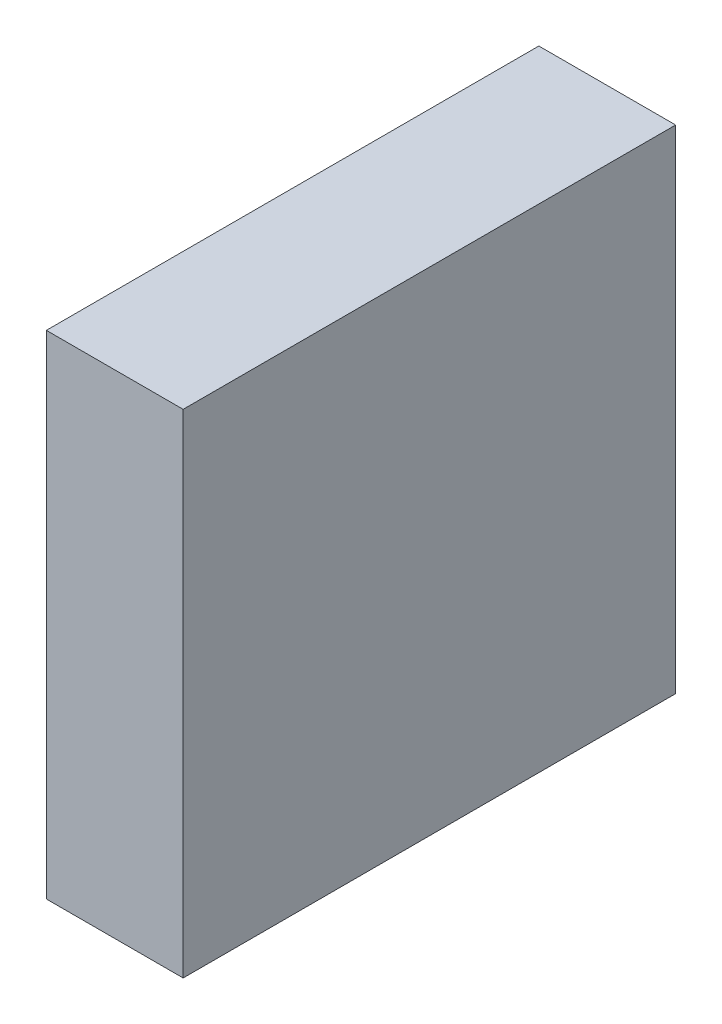
ISO-10303-21;
HEADER;
FILE_DESCRIPTION(('STEP AP214'),'2;1');
FILE_NAME('part.step','',(''),(''),'','','');
FILE_SCHEMA(('AUTOMOTIVE_DESIGN { 1 0 10303 214 1 1 1 1 }'));
ENDSEC;
DATA;
#1=APPLICATION_CONTEXT('core data for automotive mechanical design processes');
#2=APPLICATION_PROTOCOL_DEFINITION('international standard','automotive_design',2000,#1);
#3=PRODUCT_CONTEXT('',#1,'mechanical');
#4=PRODUCT('Part','Part','',(#3));
#5=PRODUCT_RELATED_PRODUCT_CATEGORY('part','',(#4));
#6=PRODUCT_DEFINITION_FORMATION('','',#4);
#7=PRODUCT_DEFINITION_CONTEXT('part definition',#1,'design');
#8=PRODUCT_DEFINITION('design','',#6,#7);
#9=PRODUCT_DEFINITION_SHAPE('','',#8);
#10=(LENGTH_UNIT() NAMED_UNIT(*) SI_UNIT(.MILLI.,.METRE.));
#11=(NAMED_UNIT(*) PLANE_ANGLE_UNIT() SI_UNIT($,.RADIAN.));
#12=(NAMED_UNIT(*) SI_UNIT($,.STERADIAN.) SOLID_ANGLE_UNIT());
#13=UNCERTAINTY_MEASURE_WITH_UNIT(LENGTH_MEASURE(1.E-05),#10,'distance_accuracy_value','');
#14=(GEOMETRIC_REPRESENTATION_CONTEXT(3) GLOBAL_UNCERTAINTY_ASSIGNED_CONTEXT((#13)) GLOBAL_UNIT_ASSIGNED_CONTEXT((#10,
#11,#12)) REPRESENTATION_CONTEXT('',''));
#15=CARTESIAN_POINT('',(0.,0.,0.));
#16=DIRECTION('',(0.,0.,1.));
#17=DIRECTION('',(1.,0.,0.));
#18=AXIS2_PLACEMENT_3D('',#15,#16,#17);
#19=CARTESIAN_POINT('',(0.2499995,-0.8999982,0.));
#20=DIRECTION('',(-1.,0.,0.));
#21=DIRECTION('',(0.,0.,1.));
#22=AXIS2_PLACEMENT_3D('',#19,#20,#21);
#23=PLANE('',#22);
#24=DIRECTION('',(0.,0.,-1.));
#25=VECTOR('',#24,1.);
#26=CARTESIAN_POINT('',(0.2499995,0.90000074,0.));
#27=LINE('',#26,#25);
#28=CARTESIAN_POINT('',(0.2499995,0.90000074,0.));
#29=VERTEX_POINT('',#28);
#30=CARTESIAN_POINT('',(0.2499995,0.90000074,1.79999894));
#31=VERTEX_POINT('',#30);
#32=EDGE_CURVE('E19',#29,#31,#27,.F.);
#33=ORIENTED_EDGE('',*,*,#32,.T.);
#34=DIRECTION('',(0.,1.,0.));
#35=VECTOR('',#34,1.);
#36=CARTESIAN_POINT('',(0.2499995,0.90000074,1.79999894));
#37=LINE('',#36,#35);
#38=CARTESIAN_POINT('',(0.2499995,-0.8999982,1.79999894));
#39=VERTEX_POINT('',#38);
#40=EDGE_CURVE('E54',#31,#39,#37,.F.);
#41=ORIENTED_EDGE('',*,*,#40,.T.);
#42=DIRECTION('',(0.,0.,1.));
#43=VECTOR('',#42,1.);
#44=CARTESIAN_POINT('',(0.2499995,-0.8999982,0.));
#45=LINE('',#44,#43);
#46=CARTESIAN_POINT('',(0.2499995,-0.8999982,0.));
#47=VERTEX_POINT('',#46);
#48=EDGE_CURVE('E75',#39,#47,#45,.F.);
#49=ORIENTED_EDGE('',*,*,#48,.T.);
#50=DIRECTION('',(0.,1.,0.));
#51=VECTOR('',#50,1.);
#52=CARTESIAN_POINT('',(0.2499995,0.90000074,0.));
#53=LINE('',#52,#51);
#54=EDGE_CURVE('E57',#29,#47,#53,.F.);
#55=ORIENTED_EDGE('',*,*,#54,.F.);
#56=EDGE_LOOP('',(#33,#41,#49,#55));
#57=FACE_BOUND('',#56,.T.);
#58=ADVANCED_FACE('F16',(#57),#23,.F.);
#59=CARTESIAN_POINT('',(0.2499995,0.90000074,0.));
#60=DIRECTION('',(0.,-1.,0.));
#61=DIRECTION('',(0.,0.,-1.));
#62=AXIS2_PLACEMENT_3D('',#59,#60,#61);
#63=PLANE('',#62);
#64=DIRECTION('',(0.,0.,-1.));
#65=VECTOR('',#64,1.);
#66=CARTESIAN_POINT('',(-0.2499995,0.90000074,0.));
#67=LINE('',#66,#65);
#68=CARTESIAN_POINT('',(-0.2499995,0.90000074,0.));
#69=VERTEX_POINT('',#68);
#70=CARTESIAN_POINT('',(-0.2499995,0.90000074,1.79999894));
#71=VERTEX_POINT('',#70);
#72=EDGE_CURVE('E72',#69,#71,#67,.F.);
#73=ORIENTED_EDGE('',*,*,#72,.T.);
#74=DIRECTION('',(-1.,0.,0.));
#75=VECTOR('',#74,1.);
#76=CARTESIAN_POINT('',(-0.2499995,0.90000074,1.79999894));
#77=LINE('',#76,#75);
#78=EDGE_CURVE('E62',#71,#31,#77,.F.);
#79=ORIENTED_EDGE('',*,*,#78,.T.);
#80=ORIENTED_EDGE('',*,*,#32,.F.);
#81=DIRECTION('',(-1.,0.,0.));
#82=VECTOR('',#81,1.);
#83=CARTESIAN_POINT('',(-0.2499995,0.90000074,0.));
#84=LINE('',#83,#82);
#85=EDGE_CURVE('E77',#69,#29,#84,.F.);
#86=ORIENTED_EDGE('',*,*,#85,.F.);
#87=EDGE_LOOP('',(#73,#79,#80,#86));
#88=FACE_BOUND('',#87,.T.);
#89=ADVANCED_FACE('F71',(#88),#63,.F.);
#90=CARTESIAN_POINT('',(-0.2499995,0.90000074,1.79999894));
#91=DIRECTION('',(0.,0.,-1.));
#92=DIRECTION('',(-1.,0.,0.));
#93=AXIS2_PLACEMENT_3D('',#90,#91,#92);
#94=PLANE('',#93);
#95=DIRECTION('',(1.,0.,0.));
#96=VECTOR('',#95,1.);
#97=CARTESIAN_POINT('',(-0.2499995,-0.8999982,1.79999894));
#98=LINE('',#97,#96);
#99=CARTESIAN_POINT('',(-0.2499995,-0.8999982,1.79999894));
#100=VERTEX_POINT('',#99);
#101=EDGE_CURVE('E68',#100,#39,#98,.T.);
#102=ORIENTED_EDGE('',*,*,#101,.T.);
#103=ORIENTED_EDGE('',*,*,#40,.F.);
#104=ORIENTED_EDGE('',*,*,#78,.F.);
#105=DIRECTION('',(0.,1.,0.));
#106=VECTOR('',#105,1.);
#107=CARTESIAN_POINT('',(-0.2499995,0.90000074,1.79999894));
#108=LINE('',#107,#106);
#109=EDGE_CURVE('E82',#71,#100,#108,.F.);
#110=ORIENTED_EDGE('',*,*,#109,.T.);
#111=EDGE_LOOP('',(#102,#103,#104,#110));
#112=FACE_BOUND('',#111,.T.);
#113=ADVANCED_FACE('F65',(#112),#94,.F.);
#114=CARTESIAN_POINT('',(-0.2499995,-0.8999982,0.));
#115=DIRECTION('',(0.,1.,0.));
#116=DIRECTION('',(0.,0.,1.));
#117=AXIS2_PLACEMENT_3D('',#114,#115,#116);
#118=PLANE('',#117);
#119=ORIENTED_EDGE('',*,*,#48,.F.);
#120=ORIENTED_EDGE('',*,*,#101,.F.);
#121=DIRECTION('',(0.,0.,-1.));
#122=VECTOR('',#121,1.);
#123=CARTESIAN_POINT('',(-0.2499995,-0.8999982,0.));
#124=LINE('',#123,#122);
#125=CARTESIAN_POINT('',(-0.2499995,-0.8999982,0.));
#126=VERTEX_POINT('',#125);
#127=EDGE_CURVE('E25',#100,#126,#124,.T.);
#128=ORIENTED_EDGE('',*,*,#127,.T.);
#129=DIRECTION('',(-1.,0.,0.));
#130=VECTOR('',#129,1.);
#131=CARTESIAN_POINT('',(-0.2499995,-0.8999982,0.));
#132=LINE('',#131,#130);
#133=EDGE_CURVE('E33',#47,#126,#132,.T.);
#134=ORIENTED_EDGE('',*,*,#133,.F.);
#135=EDGE_LOOP('',(#119,#120,#128,#134));
#136=FACE_BOUND('',#135,.T.);
#137=ADVANCED_FACE('F87',(#136),#118,.F.);
#138=CARTESIAN_POINT('',(-0.2499995,0.90000074,0.));
#139=DIRECTION('',(0.,0.,-1.));
#140=DIRECTION('',(-1.,0.,0.));
#141=AXIS2_PLACEMENT_3D('',#138,#139,#140);
#142=PLANE('',#141);
#143=ORIENTED_EDGE('',*,*,#133,.T.);
#144=DIRECTION('',(0.,1.,0.));
#145=VECTOR('',#144,1.);
#146=CARTESIAN_POINT('',(-0.2499995,0.90000074,0.));
#147=LINE('',#146,#145);
#148=EDGE_CURVE('E11',#126,#69,#147,.T.);
#149=ORIENTED_EDGE('',*,*,#148,.T.);
#150=ORIENTED_EDGE('',*,*,#85,.T.);
#151=ORIENTED_EDGE('',*,*,#54,.T.);
#152=EDGE_LOOP('',(#143,#149,#150,#151));
#153=FACE_BOUND('',#152,.T.);
#154=ADVANCED_FACE('F90',(#153),#142,.T.);
#155=CARTESIAN_POINT('',(-0.2499995,0.90000074,0.));
#156=DIRECTION('',(1.,0.,0.));
#157=DIRECTION('',(0.,0.,-1.));
#158=AXIS2_PLACEMENT_3D('',#155,#156,#157);
#159=PLANE('',#158);
#160=ORIENTED_EDGE('',*,*,#127,.F.);
#161=ORIENTED_EDGE('',*,*,#109,.F.);
#162=ORIENTED_EDGE('',*,*,#72,.F.);
#163=ORIENTED_EDGE('',*,*,#148,.F.);
#164=EDGE_LOOP('',(#160,#161,#162,#163));
#165=FACE_BOUND('',#164,.T.);
#166=ADVANCED_FACE('F89',(#165),#159,.F.);
#167=CLOSED_SHELL('',(#58,#89,#113,#137,#154,#166));
#168=MANIFOLD_SOLID_BREP('B1',#167);
#169=ADVANCED_BREP_SHAPE_REPRESENTATION('',(#18,#168),#14);
#170=SHAPE_DEFINITION_REPRESENTATION(#9,#169);
ENDSEC;
END-ISO-10303-21;
